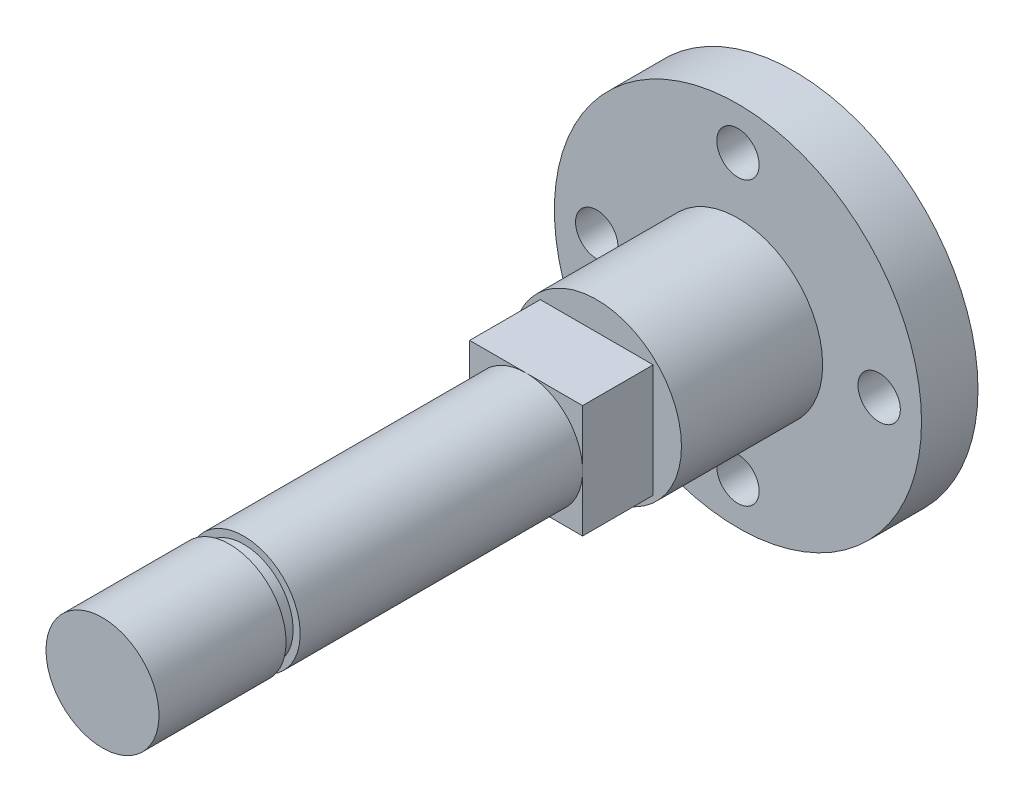
ISO-10303-21;
HEADER;
FILE_DESCRIPTION(('STEP AP214'),'2;1');
FILE_NAME('part.step','',(''),(''),'','','');
FILE_SCHEMA(('AUTOMOTIVE_DESIGN { 1 0 10303 214 1 1 1 1 }'));
ENDSEC;
DATA;
#1=APPLICATION_CONTEXT('core data for automotive mechanical design processes');
#2=APPLICATION_PROTOCOL_DEFINITION('international standard','automotive_design',2000,#1);
#3=PRODUCT_CONTEXT('',#1,'mechanical');
#4=PRODUCT('Part','Part','',(#3));
#5=PRODUCT_RELATED_PRODUCT_CATEGORY('part','',(#4));
#6=PRODUCT_DEFINITION_FORMATION('','',#4);
#7=PRODUCT_DEFINITION_CONTEXT('part definition',#1,'design');
#8=PRODUCT_DEFINITION('design','',#6,#7);
#9=PRODUCT_DEFINITION_SHAPE('','',#8);
#10=(LENGTH_UNIT() NAMED_UNIT(*) SI_UNIT(.MILLI.,.METRE.));
#11=(NAMED_UNIT(*) PLANE_ANGLE_UNIT() SI_UNIT($,.RADIAN.));
#12=(NAMED_UNIT(*) SI_UNIT($,.STERADIAN.) SOLID_ANGLE_UNIT());
#13=UNCERTAINTY_MEASURE_WITH_UNIT(LENGTH_MEASURE(1.E-05),#10,'distance_accuracy_value','');
#14=(GEOMETRIC_REPRESENTATION_CONTEXT(3) GLOBAL_UNCERTAINTY_ASSIGNED_CONTEXT((#13)) GLOBAL_UNIT_ASSIGNED_CONTEXT((#10,
#11,#12)) REPRESENTATION_CONTEXT('',''));
#15=CARTESIAN_POINT('',(0.,0.,0.));
#16=DIRECTION('',(0.,0.,1.));
#17=DIRECTION('',(1.,0.,0.));
#18=AXIS2_PLACEMENT_3D('',#15,#16,#17);
#19=CARTESIAN_POINT('',(0.,0.,49.));
#20=DIRECTION('',(0.,0.,-1.));
#21=DIRECTION('',(-1.,0.,0.));
#22=AXIS2_PLACEMENT_3D('',#19,#20,#21);
#23=CYLINDRICAL_SURFACE('',#22,4.);
#24=CARTESIAN_POINT('',(0.,0.,39.));
#25=DIRECTION('',(0.,0.,-1.));
#26=DIRECTION('',(-1.,0.,0.));
#27=AXIS2_PLACEMENT_3D('',#24,#25,#26);
#28=CIRCLE('',#27,4.);
#29=CARTESIAN_POINT('',(-4.,0.,39.));
#30=VERTEX_POINT('',#29);
#31=EDGE_CURVE('E41',#30,#30,#28,.F.);
#32=ORIENTED_EDGE('',*,*,#31,.F.);
#33=EDGE_LOOP('',(#32));
#34=FACE_BOUND('',#33,.T.);
#35=CARTESIAN_POINT('',(0.,0.,19.));
#36=DIRECTION('',(0.,0.,-1.));
#37=DIRECTION('',(-1.,0.,0.));
#38=AXIS2_PLACEMENT_3D('',#35,#36,#37);
#39=CIRCLE('',#38,4.);
#40=CARTESIAN_POINT('',(-4.,0.,19.));
#41=VERTEX_POINT('',#40);
#42=CARTESIAN_POINT('',(0.,4.,19.));
#43=VERTEX_POINT('',#42);
#44=EDGE_CURVE('E48',#41,#43,#39,.T.);
#45=ORIENTED_EDGE('',*,*,#44,.F.);
#46=CARTESIAN_POINT('',(0.,-4.,19.));
#47=VERTEX_POINT('',#46);
#48=EDGE_CURVE('E104',#47,#41,#39,.T.);
#49=ORIENTED_EDGE('',*,*,#48,.F.);
#50=CARTESIAN_POINT('',(4.,0.,19.));
#51=VERTEX_POINT('',#50);
#52=EDGE_CURVE('E46',#51,#47,#39,.T.);
#53=ORIENTED_EDGE('',*,*,#52,.F.);
#54=EDGE_CURVE('E12',#43,#51,#39,.T.);
#55=ORIENTED_EDGE('',*,*,#54,.F.);
#56=EDGE_LOOP('',(#45,#49,#53,#55));
#57=FACE_BOUND('',#56,.T.);
#58=ADVANCED_FACE('F37',(#34,#57),#23,.T.);
#59=CARTESIAN_POINT('',(0.,0.,19.));
#60=DIRECTION('',(0.,0.,-1.));
#61=DIRECTION('',(-1.,0.,0.));
#62=AXIS2_PLACEMENT_3D('',#59,#60,#61);
#63=PLANE('',#62);
#64=DIRECTION('',(0.,1.,0.));
#65=VECTOR('',#64,1.);
#66=CARTESIAN_POINT('',(-4.,0.,19.));
#67=LINE('',#66,#65);
#68=CARTESIAN_POINT('',(-4.,4.,19.));
#69=VERTEX_POINT('',#68);
#70=EDGE_CURVE('E101',#41,#69,#67,.T.);
#71=ORIENTED_EDGE('',*,*,#70,.F.);
#72=ORIENTED_EDGE('',*,*,#44,.T.);
#73=DIRECTION('',(1.,0.,0.));
#74=VECTOR('',#73,1.);
#75=CARTESIAN_POINT('',(0.,4.,19.));
#76=LINE('',#75,#74);
#77=EDGE_CURVE('E100',#69,#43,#76,.T.);
#78=ORIENTED_EDGE('',*,*,#77,.F.);
#79=EDGE_LOOP('',(#71,#72,#78));
#80=FACE_BOUND('',#79,.T.);
#81=ADVANCED_FACE('F98',(#80),#63,.F.);
#82=CARTESIAN_POINT('',(4.,4.,19.));
#83=VERTEX_POINT('',#82);
#84=EDGE_CURVE('E105',#43,#83,#76,.T.);
#85=ORIENTED_EDGE('',*,*,#84,.F.);
#86=ORIENTED_EDGE('',*,*,#54,.T.);
#87=DIRECTION('',(0.,-1.,0.));
#88=VECTOR('',#87,1.);
#89=CARTESIAN_POINT('',(4.,0.,19.));
#90=LINE('',#89,#88);
#91=EDGE_CURVE('E108',#83,#51,#90,.T.);
#92=ORIENTED_EDGE('',*,*,#91,.F.);
#93=EDGE_LOOP('',(#85,#86,#92));
#94=FACE_BOUND('',#93,.T.);
#95=ADVANCED_FACE('F106',(#94),#63,.F.);
#96=CARTESIAN_POINT('',(4.,-4.,19.));
#97=VERTEX_POINT('',#96);
#98=EDGE_CURVE('E117',#51,#97,#90,.T.);
#99=ORIENTED_EDGE('',*,*,#98,.F.);
#100=ORIENTED_EDGE('',*,*,#52,.T.);
#101=DIRECTION('',(-1.,0.,0.));
#102=VECTOR('',#101,1.);
#103=CARTESIAN_POINT('',(0.,-4.,19.));
#104=LINE('',#103,#102);
#105=EDGE_CURVE('E196',#97,#47,#104,.T.);
#106=ORIENTED_EDGE('',*,*,#105,.F.);
#107=EDGE_LOOP('',(#99,#100,#106));
#108=FACE_BOUND('',#107,.T.);
#109=ADVANCED_FACE('F209',(#108),#63,.F.);
#110=CARTESIAN_POINT('',(0.,0.,14.));
#111=DIRECTION('',(0.,0.,1.));
#112=DIRECTION('',(1.,0.,0.));
#113=AXIS2_PLACEMENT_3D('',#110,#111,#112);
#114=PLANE('',#113);
#115=CARTESIAN_POINT('',(0.,0.,14.));
#116=DIRECTION('',(0.,0.,1.));
#117=DIRECTION('',(1.,0.,0.));
#118=AXIS2_PLACEMENT_3D('',#115,#116,#117);
#119=CIRCLE('',#118,6.);
#120=CARTESIAN_POINT('',(6.,0.,14.));
#121=VERTEX_POINT('',#120);
#122=EDGE_CURVE('E141',#121,#121,#119,.T.);
#123=ORIENTED_EDGE('',*,*,#122,.T.);
#124=EDGE_LOOP('',(#123));
#125=FACE_BOUND('',#124,.T.);
#126=DIRECTION('',(0.,-1.,0.));
#127=VECTOR('',#126,1.);
#128=CARTESIAN_POINT('',(4.,0.,14.));
#129=LINE('',#128,#127);
#130=CARTESIAN_POINT('',(4.,4.,14.));
#131=VERTEX_POINT('',#130);
#132=CARTESIAN_POINT('',(4.,-4.,14.));
#133=VERTEX_POINT('',#132);
#134=EDGE_CURVE('E130',#131,#133,#129,.T.);
#135=ORIENTED_EDGE('',*,*,#134,.T.);
#136=DIRECTION('',(-1.,0.,0.));
#137=VECTOR('',#136,1.);
#138=CARTESIAN_POINT('',(0.,-4.,14.));
#139=LINE('',#138,#137);
#140=CARTESIAN_POINT('',(-4.,-4.,14.));
#141=VERTEX_POINT('',#140);
#142=EDGE_CURVE('E62',#133,#141,#139,.T.);
#143=ORIENTED_EDGE('',*,*,#142,.T.);
#144=DIRECTION('',(0.,1.,0.));
#145=VECTOR('',#144,1.);
#146=CARTESIAN_POINT('',(-4.,0.,14.));
#147=LINE('',#146,#145);
#148=CARTESIAN_POINT('',(-4.,4.,14.));
#149=VERTEX_POINT('',#148);
#150=EDGE_CURVE('E124',#141,#149,#147,.T.);
#151=ORIENTED_EDGE('',*,*,#150,.T.);
#152=DIRECTION('',(1.,0.,0.));
#153=VECTOR('',#152,1.);
#154=CARTESIAN_POINT('',(0.,4.,14.));
#155=LINE('',#154,#153);
#156=EDGE_CURVE('E127',#149,#131,#155,.T.);
#157=ORIENTED_EDGE('',*,*,#156,.T.);
#158=EDGE_LOOP('',(#135,#143,#151,#157));
#159=FACE_BOUND('',#158,.T.);
#160=ADVANCED_FACE('F214',(#125,#159),#114,.T.);
#161=CARTESIAN_POINT('',(0.,0.,4.));
#162=DIRECTION('',(0.,0.,-1.));
#163=DIRECTION('',(-1.,0.,0.));
#164=AXIS2_PLACEMENT_3D('',#161,#162,#163);
#165=CYLINDRICAL_SURFACE('',#164,13.);
#166=CARTESIAN_POINT('',(0.,0.,4.));
#167=DIRECTION('',(0.,0.,1.));
#168=DIRECTION('',(1.,0.,0.));
#169=AXIS2_PLACEMENT_3D('',#166,#167,#168);
#170=CIRCLE('',#169,13.);
#171=CARTESIAN_POINT('',(13.,0.,4.));
#172=VERTEX_POINT('',#171);
#173=EDGE_CURVE('E177',#172,#172,#170,.T.);
#174=ORIENTED_EDGE('',*,*,#173,.F.);
#175=EDGE_LOOP('',(#174));
#176=FACE_BOUND('',#175,.T.);
#177=CARTESIAN_POINT('',(0.,0.,0.));
#178=DIRECTION('',(0.,0.,1.));
#179=DIRECTION('',(1.,0.,0.));
#180=AXIS2_PLACEMENT_3D('',#177,#178,#179);
#181=CIRCLE('',#180,13.);
#182=CARTESIAN_POINT('',(13.,0.,0.));
#183=VERTEX_POINT('',#182);
#184=EDGE_CURVE('E174',#183,#183,#181,.T.);
#185=ORIENTED_EDGE('',*,*,#184,.T.);
#186=EDGE_LOOP('',(#185));
#187=FACE_BOUND('',#186,.T.);
#188=ADVANCED_FACE('F39',(#176,#187),#165,.T.);
#189=CARTESIAN_POINT('',(0.,0.,4.));
#190=DIRECTION('',(0.,0.,1.));
#191=DIRECTION('',(1.,0.,0.));
#192=AXIS2_PLACEMENT_3D('',#189,#190,#191);
#193=PLANE('',#192);
#194=CARTESIAN_POINT('',(0.,0.,4.));
#195=DIRECTION('',(0.,0.,1.));
#196=DIRECTION('',(1.,0.,0.));
#197=AXIS2_PLACEMENT_3D('',#194,#195,#196);
#198=CIRCLE('',#197,6.);
#199=CARTESIAN_POINT('',(6.,0.,4.));
#200=VERTEX_POINT('',#199);
#201=EDGE_CURVE('E136',#200,#200,#198,.T.);
#202=ORIENTED_EDGE('',*,*,#201,.F.);
#203=EDGE_LOOP('',(#202));
#204=FACE_BOUND('',#203,.T.);
#205=CARTESIAN_POINT('',(0.,10.,4.));
#206=DIRECTION('',(0.,0.,1.));
#207=DIRECTION('',(1.,0.,0.));
#208=AXIS2_PLACEMENT_3D('',#205,#206,#207);
#209=CIRCLE('',#208,1.5);
#210=CARTESIAN_POINT('',(1.5,10.,4.));
#211=VERTEX_POINT('',#210);
#212=EDGE_CURVE('E151',#211,#211,#209,.T.);
#213=ORIENTED_EDGE('',*,*,#212,.F.);
#214=EDGE_LOOP('',(#213));
#215=FACE_BOUND('',#214,.T.);
#216=CARTESIAN_POINT('',(10.,0.,4.));
#217=DIRECTION('',(0.,0.,1.));
#218=DIRECTION('',(1.,0.,0.));
#219=AXIS2_PLACEMENT_3D('',#216,#217,#218);
#220=CIRCLE('',#219,1.5);
#221=CARTESIAN_POINT('',(11.5,0.,4.));
#222=VERTEX_POINT('',#221);
#223=EDGE_CURVE('E157',#222,#222,#220,.T.);
#224=ORIENTED_EDGE('',*,*,#223,.F.);
#225=EDGE_LOOP('',(#224));
#226=FACE_BOUND('',#225,.T.);
#227=CARTESIAN_POINT('',(0.,-10.,4.));
#228=DIRECTION('',(0.,0.,1.));
#229=DIRECTION('',(1.,0.,0.));
#230=AXIS2_PLACEMENT_3D('',#227,#228,#229);
#231=CIRCLE('',#230,1.50000000000027);
#232=CARTESIAN_POINT('',(1.50000000000027,-10.,4.));
#233=VERTEX_POINT('',#232);
#234=EDGE_CURVE('E163',#233,#233,#231,.T.);
#235=ORIENTED_EDGE('',*,*,#234,.F.);
#236=EDGE_LOOP('',(#235));
#237=FACE_BOUND('',#236,.T.);
#238=CARTESIAN_POINT('',(-9.99999999999986,-1.41488383509358E-13,4.));
#239=DIRECTION('',(0.,0.,1.));
#240=DIRECTION('',(1.,0.,0.));
#241=AXIS2_PLACEMENT_3D('',#238,#239,#240);
#242=CIRCLE('',#241,1.5);
#243=CARTESIAN_POINT('',(-8.49999999999986,-1.41488383509358E-13,4.));
#244=VERTEX_POINT('',#243);
#245=EDGE_CURVE('E144',#244,#244,#242,.T.);
#246=ORIENTED_EDGE('',*,*,#245,.F.);
#247=EDGE_LOOP('',(#246));
#248=FACE_BOUND('',#247,.T.);
#249=ORIENTED_EDGE('',*,*,#173,.T.);
#250=EDGE_LOOP('',(#249));
#251=FACE_BOUND('',#250,.T.);
#252=ADVANCED_FACE('F222',(#204,#215,#226,#237,#248,#251),#193,.T.);
#253=CARTESIAN_POINT('',(0.,0.,0.));
#254=DIRECTION('',(0.,0.,1.));
#255=DIRECTION('',(1.,0.,0.));
#256=AXIS2_PLACEMENT_3D('',#253,#254,#255);
#257=PLANE('',#256);
#258=CARTESIAN_POINT('',(0.,10.,0.));
#259=DIRECTION('',(0.,0.,1.));
#260=DIRECTION('',(1.,0.,0.));
#261=AXIS2_PLACEMENT_3D('',#258,#259,#260);
#262=CIRCLE('',#261,1.5);
#263=CARTESIAN_POINT('',(1.5,10.,0.));
#264=VERTEX_POINT('',#263);
#265=EDGE_CURVE('E147',#264,#264,#262,.T.);
#266=ORIENTED_EDGE('',*,*,#265,.T.);
#267=EDGE_LOOP('',(#266));
#268=FACE_BOUND('',#267,.T.);
#269=CARTESIAN_POINT('',(10.,0.,0.));
#270=DIRECTION('',(0.,0.,1.));
#271=DIRECTION('',(1.,0.,0.));
#272=AXIS2_PLACEMENT_3D('',#269,#270,#271);
#273=CIRCLE('',#272,1.5);
#274=CARTESIAN_POINT('',(11.5,0.,0.));
#275=VERTEX_POINT('',#274);
#276=EDGE_CURVE('E154',#275,#275,#273,.T.);
#277=ORIENTED_EDGE('',*,*,#276,.T.);
#278=EDGE_LOOP('',(#277));
#279=FACE_BOUND('',#278,.T.);
#280=CARTESIAN_POINT('',(0.,-10.,0.));
#281=DIRECTION('',(0.,0.,1.));
#282=DIRECTION('',(1.,0.,0.));
#283=AXIS2_PLACEMENT_3D('',#280,#281,#282);
#284=CIRCLE('',#283,1.50000000000027);
#285=CARTESIAN_POINT('',(1.50000000000027,-10.,0.));
#286=VERTEX_POINT('',#285);
#287=EDGE_CURVE('E160',#286,#286,#284,.T.);
#288=ORIENTED_EDGE('',*,*,#287,.T.);
#289=EDGE_LOOP('',(#288));
#290=FACE_BOUND('',#289,.T.);
#291=CARTESIAN_POINT('',(-9.99999999999986,-1.41488383509358E-13,0.));
#292=DIRECTION('',(0.,0.,1.));
#293=DIRECTION('',(1.,0.,0.));
#294=AXIS2_PLACEMENT_3D('',#291,#292,#293);
#295=CIRCLE('',#294,1.5);
#296=CARTESIAN_POINT('',(-8.49999999999986,-1.41488383509358E-13,0.));
#297=VERTEX_POINT('',#296);
#298=EDGE_CURVE('E166',#297,#297,#295,.T.);
#299=ORIENTED_EDGE('',*,*,#298,.T.);
#300=EDGE_LOOP('',(#299));
#301=FACE_BOUND('',#300,.T.);
#302=CARTESIAN_POINT('',(0.,0.,0.));
#303=DIRECTION('',(0.,0.,-1.));
#304=DIRECTION('',(-1.,0.,0.));
#305=AXIS2_PLACEMENT_3D('',#302,#303,#304);
#306=CIRCLE('',#305,7.25);
#307=CARTESIAN_POINT('',(-7.25,0.,0.));
#308=VERTEX_POINT('',#307);
#309=EDGE_CURVE('E150',#308,#308,#306,.T.);
#310=ORIENTED_EDGE('',*,*,#309,.F.);
#311=EDGE_LOOP('',(#310));
#312=FACE_BOUND('',#311,.T.);
#313=ORIENTED_EDGE('',*,*,#184,.F.);
#314=EDGE_LOOP('',(#313));
#315=FACE_BOUND('',#314,.T.);
#316=ADVANCED_FACE('F366',(#268,#279,#290,#301,#312,#315),#257,.F.);
#317=CARTESIAN_POINT('',(0.,0.,3.));
#318=DIRECTION('',(0.,0.,-1.));
#319=DIRECTION('',(-1.,0.,0.));
#320=AXIS2_PLACEMENT_3D('',#317,#318,#319);
#321=CYLINDRICAL_SURFACE('',#320,7.25);
#322=CARTESIAN_POINT('',(0.,0.,3.));
#323=DIRECTION('',(0.,0.,-1.));
#324=DIRECTION('',(-1.,0.,0.));
#325=AXIS2_PLACEMENT_3D('',#322,#323,#324);
#326=CIRCLE('',#325,7.25);
#327=CARTESIAN_POINT('',(-7.25,0.,3.));
#328=VERTEX_POINT('',#327);
#329=EDGE_CURVE('E171',#328,#328,#326,.T.);
#330=ORIENTED_EDGE('',*,*,#329,.F.);
#331=EDGE_LOOP('',(#330));
#332=FACE_BOUND('',#331,.T.);
#333=ORIENTED_EDGE('',*,*,#309,.T.);
#334=EDGE_LOOP('',(#333));
#335=FACE_BOUND('',#334,.T.);
#336=ADVANCED_FACE('F417',(#332,#335),#321,.F.);
#337=CARTESIAN_POINT('',(0.,0.,3.));
#338=DIRECTION('',(0.,0.,-1.));
#339=DIRECTION('',(-1.,0.,0.));
#340=AXIS2_PLACEMENT_3D('',#337,#338,#339);
#341=PLANE('',#340);
#342=ORIENTED_EDGE('',*,*,#329,.T.);
#343=EDGE_LOOP('',(#342));
#344=FACE_BOUND('',#343,.T.);
#345=ADVANCED_FACE('F407',(#344),#341,.T.);
#346=CARTESIAN_POINT('',(-9.99999999999986,-1.41488383509358E-13,0.));
#347=DIRECTION('',(0.,0.,1.));
#348=DIRECTION('',(1.,0.,0.));
#349=AXIS2_PLACEMENT_3D('',#346,#347,#348);
#350=CYLINDRICAL_SURFACE('',#349,1.5);
#351=ORIENTED_EDGE('',*,*,#298,.F.);
#352=EDGE_LOOP('',(#351));
#353=FACE_BOUND('',#352,.T.);
#354=ORIENTED_EDGE('',*,*,#245,.T.);
#355=EDGE_LOOP('',(#354));
#356=FACE_BOUND('',#355,.T.);
#357=ADVANCED_FACE('F397',(#353,#356),#350,.F.);
#358=CARTESIAN_POINT('',(0.,-10.,0.));
#359=DIRECTION('',(0.,0.,1.));
#360=DIRECTION('',(1.,0.,0.));
#361=AXIS2_PLACEMENT_3D('',#358,#359,#360);
#362=CYLINDRICAL_SURFACE('',#361,1.50000000000027);
#363=ORIENTED_EDGE('',*,*,#287,.F.);
#364=EDGE_LOOP('',(#363));
#365=FACE_BOUND('',#364,.T.);
#366=ORIENTED_EDGE('',*,*,#234,.T.);
#367=EDGE_LOOP('',(#366));
#368=FACE_BOUND('',#367,.T.);
#369=ADVANCED_FACE('F387',(#365,#368),#362,.F.);
#370=CARTESIAN_POINT('',(10.,0.,0.));
#371=DIRECTION('',(0.,0.,1.));
#372=DIRECTION('',(1.,0.,0.));
#373=AXIS2_PLACEMENT_3D('',#370,#371,#372);
#374=CYLINDRICAL_SURFACE('',#373,1.5);
#375=ORIENTED_EDGE('',*,*,#276,.F.);
#376=EDGE_LOOP('',(#375));
#377=FACE_BOUND('',#376,.T.);
#378=ORIENTED_EDGE('',*,*,#223,.T.);
#379=EDGE_LOOP('',(#378));
#380=FACE_BOUND('',#379,.T.);
#381=ADVANCED_FACE('F377',(#377,#380),#374,.F.);
#382=CARTESIAN_POINT('',(0.,10.,0.));
#383=DIRECTION('',(0.,0.,1.));
#384=DIRECTION('',(1.,0.,0.));
#385=AXIS2_PLACEMENT_3D('',#382,#383,#384);
#386=CYLINDRICAL_SURFACE('',#385,1.5);
#387=ORIENTED_EDGE('',*,*,#265,.F.);
#388=EDGE_LOOP('',(#387));
#389=FACE_BOUND('',#388,.T.);
#390=ORIENTED_EDGE('',*,*,#212,.T.);
#391=EDGE_LOOP('',(#390));
#392=FACE_BOUND('',#391,.T.);
#393=ADVANCED_FACE('F355',(#389,#392),#386,.F.);
#394=CARTESIAN_POINT('',(0.,0.,14.));
#395=DIRECTION('',(0.,0.,-1.));
#396=DIRECTION('',(-1.,0.,0.));
#397=AXIS2_PLACEMENT_3D('',#394,#395,#396);
#398=CYLINDRICAL_SURFACE('',#397,6.);
#399=ORIENTED_EDGE('',*,*,#122,.F.);
#400=EDGE_LOOP('',(#399));
#401=FACE_BOUND('',#400,.T.);
#402=ORIENTED_EDGE('',*,*,#201,.T.);
#403=EDGE_LOOP('',(#402));
#404=FACE_BOUND('',#403,.T.);
#405=ADVANCED_FACE('F330',(#401,#404),#398,.T.);
#406=CARTESIAN_POINT('',(0.,-4.,19.));
#407=DIRECTION('',(0.,-1.,0.));
#408=DIRECTION('',(0.,0.,-1.));
#409=AXIS2_PLACEMENT_3D('',#406,#407,#408);
#410=PLANE('',#409);
#411=ORIENTED_EDGE('',*,*,#142,.F.);
#412=DIRECTION('',(0.,0.,-1.));
#413=VECTOR('',#412,1.);
#414=CARTESIAN_POINT('',(4.,-4.,19.));
#415=LINE('',#414,#413);
#416=EDGE_CURVE('E134',#97,#133,#415,.T.);
#417=ORIENTED_EDGE('',*,*,#416,.F.);
#418=ORIENTED_EDGE('',*,*,#105,.T.);
#419=CARTESIAN_POINT('',(-4.,-4.,19.));
#420=VERTEX_POINT('',#419);
#421=EDGE_CURVE('E133',#47,#420,#104,.T.);
#422=ORIENTED_EDGE('',*,*,#421,.T.);
#423=DIRECTION('',(0.,0.,-1.));
#424=VECTOR('',#423,1.);
#425=CARTESIAN_POINT('',(-4.,-4.,19.));
#426=LINE('',#425,#424);
#427=EDGE_CURVE('E122',#420,#141,#426,.T.);
#428=ORIENTED_EDGE('',*,*,#427,.T.);
#429=EDGE_LOOP('',(#411,#417,#418,#422,#428));
#430=FACE_BOUND('',#429,.T.);
#431=ADVANCED_FACE('F201',(#430),#410,.T.);
#432=CARTESIAN_POINT('',(4.,0.,19.));
#433=DIRECTION('',(1.,0.,0.));
#434=DIRECTION('',(0.,1.,0.));
#435=AXIS2_PLACEMENT_3D('',#432,#433,#434);
#436=PLANE('',#435);
#437=ORIENTED_EDGE('',*,*,#134,.F.);
#438=DIRECTION('',(0.,0.,-1.));
#439=VECTOR('',#438,1.);
#440=CARTESIAN_POINT('',(4.,4.,19.));
#441=LINE('',#440,#439);
#442=EDGE_CURVE('E137',#83,#131,#441,.T.);
#443=ORIENTED_EDGE('',*,*,#442,.F.);
#444=ORIENTED_EDGE('',*,*,#91,.T.);
#445=ORIENTED_EDGE('',*,*,#98,.T.);
#446=ORIENTED_EDGE('',*,*,#416,.T.);
#447=EDGE_LOOP('',(#437,#443,#444,#445,#446));
#448=FACE_BOUND('',#447,.T.);
#449=ADVANCED_FACE('F212',(#448),#436,.T.);
#450=CARTESIAN_POINT('',(0.,4.,19.));
#451=DIRECTION('',(0.,1.,0.));
#452=DIRECTION('',(0.,0.,1.));
#453=AXIS2_PLACEMENT_3D('',#450,#451,#452);
#454=PLANE('',#453);
#455=ORIENTED_EDGE('',*,*,#156,.F.);
#456=DIRECTION('',(0.,0.,-1.));
#457=VECTOR('',#456,1.);
#458=CARTESIAN_POINT('',(-4.,4.,19.));
#459=LINE('',#458,#457);
#460=EDGE_CURVE('E116',#69,#149,#459,.T.);
#461=ORIENTED_EDGE('',*,*,#460,.F.);
#462=ORIENTED_EDGE('',*,*,#77,.T.);
#463=ORIENTED_EDGE('',*,*,#84,.T.);
#464=ORIENTED_EDGE('',*,*,#442,.T.);
#465=EDGE_LOOP('',(#455,#461,#462,#463,#464));
#466=FACE_BOUND('',#465,.T.);
#467=ADVANCED_FACE('F115',(#466),#454,.T.);
#468=CARTESIAN_POINT('',(-4.,0.,19.));
#469=DIRECTION('',(-1.,0.,0.));
#470=DIRECTION('',(0.,-1.,0.));
#471=AXIS2_PLACEMENT_3D('',#468,#469,#470);
#472=PLANE('',#471);
#473=ORIENTED_EDGE('',*,*,#150,.F.);
#474=ORIENTED_EDGE('',*,*,#427,.F.);
#475=EDGE_CURVE('E111',#420,#41,#67,.T.);
#476=ORIENTED_EDGE('',*,*,#475,.T.);
#477=ORIENTED_EDGE('',*,*,#70,.T.);
#478=ORIENTED_EDGE('',*,*,#460,.T.);
#479=EDGE_LOOP('',(#473,#474,#476,#477,#478));
#480=FACE_BOUND('',#479,.T.);
#481=ADVANCED_FACE('F206',(#480),#472,.T.);
#482=ORIENTED_EDGE('',*,*,#421,.F.);
#483=ORIENTED_EDGE('',*,*,#48,.T.);
#484=ORIENTED_EDGE('',*,*,#475,.F.);
#485=EDGE_LOOP('',(#482,#483,#484));
#486=FACE_BOUND('',#485,.T.);
#487=ADVANCED_FACE('F207',(#486),#63,.F.);
#488=CARTESIAN_POINT('',(0.,0.,0.));
#489=DIRECTION('',(0.,0.,-1.));
#490=DIRECTION('',(-1.,0.,0.));
#491=AXIS2_PLACEMENT_3D('',#488,#489,#490);
#492=CYLINDRICAL_SURFACE('',#491,3.5);
#493=CARTESIAN_POINT('',(0.,0.,39.));
#494=DIRECTION('',(0.,0.,-1.));
#495=DIRECTION('',(-1.,0.,0.));
#496=AXIS2_PLACEMENT_3D('',#493,#494,#495);
#497=CIRCLE('',#496,3.5);
#498=CARTESIAN_POINT('',(-3.5,0.,39.));
#499=VERTEX_POINT('',#498);
#500=EDGE_CURVE('E183',#499,#499,#497,.T.);
#501=ORIENTED_EDGE('',*,*,#500,.F.);
#502=EDGE_LOOP('',(#501));
#503=FACE_BOUND('',#502,.T.);
#504=CARTESIAN_POINT('',(0.,0.,40.));
#505=DIRECTION('',(0.,0.,-1.));
#506=DIRECTION('',(-1.,0.,0.));
#507=AXIS2_PLACEMENT_3D('',#504,#505,#506);
#508=CIRCLE('',#507,3.49999999999999);
#509=CARTESIAN_POINT('',(-3.49999999999999,0.,40.));
#510=VERTEX_POINT('',#509);
#511=EDGE_CURVE('E188',#510,#510,#508,.T.);
#512=ORIENTED_EDGE('',*,*,#511,.T.);
#513=EDGE_LOOP('',(#512));
#514=FACE_BOUND('',#513,.T.);
#515=ADVANCED_FACE('F252',(#503,#514),#492,.T.);
#516=CARTESIAN_POINT('',(-5.5,0.,39.));
#517=DIRECTION('',(0.,0.,-1.));
#518=DIRECTION('',(-1.,0.,0.));
#519=AXIS2_PLACEMENT_3D('',#516,#517,#518);
#520=PLANE('',#519);
#521=ORIENTED_EDGE('',*,*,#31,.T.);
#522=EDGE_LOOP('',(#521));
#523=FACE_BOUND('',#522,.T.);
#524=ORIENTED_EDGE('',*,*,#500,.T.);
#525=EDGE_LOOP('',(#524));
#526=FACE_BOUND('',#525,.T.);
#527=ADVANCED_FACE('F249',(#523,#526),#520,.F.);
#528=CARTESIAN_POINT('',(-5.5,0.,40.));
#529=DIRECTION('',(0.,0.,1.));
#530=DIRECTION('',(1.,0.,0.));
#531=AXIS2_PLACEMENT_3D('',#528,#529,#530);
#532=PLANE('',#531);
#533=CARTESIAN_POINT('',(0.,0.,40.));
#534=DIRECTION('',(0.,0.,1.));
#535=DIRECTION('',(1.,0.,0.));
#536=AXIS2_PLACEMENT_3D('',#533,#534,#535);
#537=CIRCLE('',#536,4.);
#538=CARTESIAN_POINT('',(4.,0.,40.));
#539=VERTEX_POINT('',#538);
#540=EDGE_CURVE('E181',#539,#539,#537,.F.);
#541=ORIENTED_EDGE('',*,*,#540,.T.);
#542=EDGE_LOOP('',(#541));
#543=FACE_BOUND('',#542,.T.);
#544=ORIENTED_EDGE('',*,*,#511,.F.);
#545=EDGE_LOOP('',(#544));
#546=FACE_BOUND('',#545,.T.);
#547=ADVANCED_FACE('F242',(#543,#546),#532,.F.);
#548=CARTESIAN_POINT('',(0.,0.,49.));
#549=DIRECTION('',(0.,0.,-1.));
#550=DIRECTION('',(-1.,0.,0.));
#551=AXIS2_PLACEMENT_3D('',#548,#549,#550);
#552=PLANE('',#551);
#553=CARTESIAN_POINT('',(0.,0.,49.));
#554=DIRECTION('',(0.,0.,-1.));
#555=DIRECTION('',(-1.,0.,0.));
#556=AXIS2_PLACEMENT_3D('',#553,#554,#555);
#557=CIRCLE('',#556,4.);
#558=CARTESIAN_POINT('',(-4.,0.,49.));
#559=VERTEX_POINT('',#558);
#560=EDGE_CURVE('E103',#559,#559,#557,.T.);
#561=ORIENTED_EDGE('',*,*,#560,.F.);
#562=EDGE_LOOP('',(#561));
#563=FACE_BOUND('',#562,.T.);
#564=ADVANCED_FACE('F237',(#563),#552,.F.);
#565=ORIENTED_EDGE('',*,*,#540,.F.);
#566=EDGE_LOOP('',(#565));
#567=FACE_BOUND('',#566,.T.);
#568=ORIENTED_EDGE('',*,*,#560,.T.);
#569=EDGE_LOOP('',(#568));
#570=FACE_BOUND('',#569,.T.);
#571=ADVANCED_FACE('F230',(#567,#570),#23,.T.);
#572=CLOSED_SHELL('',(#58,#81,#95,#109,#160,#188,#252,#316,#336,#345,#357,#369,#381,#393,#405,
#431,#449,#467,#481,#487,#515,#527,#547,#564,#571));
#573=MANIFOLD_SOLID_BREP('B2',#572);
#574=ADVANCED_BREP_SHAPE_REPRESENTATION('',(#18,#573),#14);
#575=SHAPE_DEFINITION_REPRESENTATION(#9,#574);
ENDSEC;
END-ISO-10303-21;
